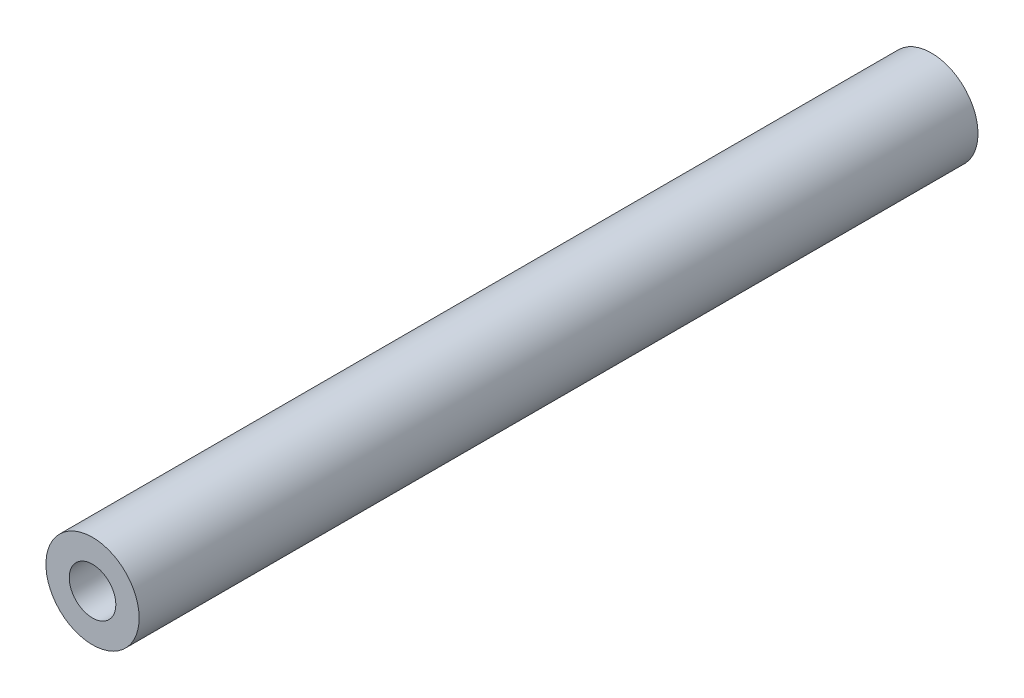
ISO-10303-21;
HEADER;
FILE_DESCRIPTION(('STEP AP214'),'2;1');
FILE_NAME('part.step','',(''),(''),'','','');
FILE_SCHEMA(('AUTOMOTIVE_DESIGN { 1 0 10303 214 1 1 1 1 }'));
ENDSEC;
DATA;
#1=APPLICATION_CONTEXT('core data for automotive mechanical design processes');
#2=APPLICATION_PROTOCOL_DEFINITION('international standard','automotive_design',2000,#1);
#3=PRODUCT_CONTEXT('',#1,'mechanical');
#4=PRODUCT('Part','Part','',(#3));
#5=PRODUCT_RELATED_PRODUCT_CATEGORY('part','',(#4));
#6=PRODUCT_DEFINITION_FORMATION('','',#4);
#7=PRODUCT_DEFINITION_CONTEXT('part definition',#1,'design');
#8=PRODUCT_DEFINITION('design','',#6,#7);
#9=PRODUCT_DEFINITION_SHAPE('','',#8);
#10=(LENGTH_UNIT() NAMED_UNIT(*) SI_UNIT(.MILLI.,.METRE.));
#11=(NAMED_UNIT(*) PLANE_ANGLE_UNIT() SI_UNIT($,.RADIAN.));
#12=(NAMED_UNIT(*) SI_UNIT($,.STERADIAN.) SOLID_ANGLE_UNIT());
#13=UNCERTAINTY_MEASURE_WITH_UNIT(LENGTH_MEASURE(1.E-05),#10,'distance_accuracy_value','');
#14=(GEOMETRIC_REPRESENTATION_CONTEXT(3) GLOBAL_UNCERTAINTY_ASSIGNED_CONTEXT((#13)) GLOBAL_UNIT_ASSIGNED_CONTEXT((#10,
#11,#12)) REPRESENTATION_CONTEXT('',''));
#15=CARTESIAN_POINT('',(0.,0.,0.));
#16=DIRECTION('',(0.,0.,1.));
#17=DIRECTION('',(1.,0.,0.));
#18=AXIS2_PLACEMENT_3D('',#15,#16,#17);
#19=CARTESIAN_POINT('',(0.,0.,45.));
#20=DIRECTION('',(0.,0.,1.));
#21=DIRECTION('',(1.,0.,0.));
#22=AXIS2_PLACEMENT_3D('',#19,#20,#21);
#23=PLANE('',#22);
#24=CARTESIAN_POINT('',(0.,0.,45.));
#25=DIRECTION('',(0.,0.,1.));
#26=DIRECTION('',(1.,0.,0.));
#27=AXIS2_PLACEMENT_3D('',#24,#25,#26);
#28=CIRCLE('',#27,2.5);
#29=CARTESIAN_POINT('',(2.5,0.,45.));
#30=VERTEX_POINT('',#29);
#31=EDGE_CURVE('E10',#30,#30,#28,.T.);
#32=ORIENTED_EDGE('',*,*,#31,.T.);
#33=EDGE_LOOP('',(#32));
#34=FACE_BOUND('',#33,.T.);
#35=CARTESIAN_POINT('',(0.,0.,45.));
#36=DIRECTION('',(0.,0.,1.));
#37=DIRECTION('',(1.,0.,0.));
#38=AXIS2_PLACEMENT_3D('',#35,#36,#37);
#39=CIRCLE('',#38,1.25);
#40=CARTESIAN_POINT('',(1.25,0.,45.));
#41=VERTEX_POINT('',#40);
#42=EDGE_CURVE('E42',#41,#41,#39,.T.);
#43=ORIENTED_EDGE('',*,*,#42,.F.);
#44=EDGE_LOOP('',(#43));
#45=FACE_BOUND('',#44,.T.);
#46=ADVANCED_FACE('F31',(#34,#45),#23,.T.);
#47=CARTESIAN_POINT('',(0.,0.,0.));
#48=DIRECTION('',(0.,0.,1.));
#49=DIRECTION('',(1.,0.,0.));
#50=AXIS2_PLACEMENT_3D('',#47,#48,#49);
#51=PLANE('',#50);
#52=CARTESIAN_POINT('',(0.,0.,0.));
#53=DIRECTION('',(0.,0.,1.));
#54=DIRECTION('',(1.,0.,0.));
#55=AXIS2_PLACEMENT_3D('',#52,#53,#54);
#56=CIRCLE('',#55,2.5);
#57=CARTESIAN_POINT('',(2.5,0.,0.));
#58=VERTEX_POINT('',#57);
#59=EDGE_CURVE('E35',#58,#58,#56,.T.);
#60=ORIENTED_EDGE('',*,*,#59,.F.);
#61=EDGE_LOOP('',(#60));
#62=FACE_BOUND('',#61,.T.);
#63=CARTESIAN_POINT('',(0.,0.,0.));
#64=DIRECTION('',(0.,0.,1.));
#65=DIRECTION('',(1.,0.,0.));
#66=AXIS2_PLACEMENT_3D('',#63,#64,#65);
#67=CIRCLE('',#66,1.25);
#68=CARTESIAN_POINT('',(1.25,0.,0.));
#69=VERTEX_POINT('',#68);
#70=EDGE_CURVE('E44',#69,#69,#67,.T.);
#71=ORIENTED_EDGE('',*,*,#70,.T.);
#72=EDGE_LOOP('',(#71));
#73=FACE_BOUND('',#72,.T.);
#74=ADVANCED_FACE('F54',(#62,#73),#51,.F.);
#75=CARTESIAN_POINT('',(0.,0.,45.));
#76=DIRECTION('',(0.,0.,-1.));
#77=DIRECTION('',(-1.,0.,0.));
#78=AXIS2_PLACEMENT_3D('',#75,#76,#77);
#79=CYLINDRICAL_SURFACE('',#78,2.5);
#80=ORIENTED_EDGE('',*,*,#31,.F.);
#81=EDGE_LOOP('',(#80));
#82=FACE_BOUND('',#81,.T.);
#83=ORIENTED_EDGE('',*,*,#59,.T.);
#84=EDGE_LOOP('',(#83));
#85=FACE_BOUND('',#84,.T.);
#86=ADVANCED_FACE('F33',(#82,#85),#79,.T.);
#87=CARTESIAN_POINT('',(0.,0.,45.));
#88=DIRECTION('',(0.,0.,-1.));
#89=DIRECTION('',(-1.,0.,0.));
#90=AXIS2_PLACEMENT_3D('',#87,#88,#89);
#91=CYLINDRICAL_SURFACE('',#90,1.25);
#92=ORIENTED_EDGE('',*,*,#42,.T.);
#93=EDGE_LOOP('',(#92));
#94=FACE_BOUND('',#93,.T.);
#95=ORIENTED_EDGE('',*,*,#70,.F.);
#96=EDGE_LOOP('',(#95));
#97=FACE_BOUND('',#96,.T.);
#98=ADVANCED_FACE('F50',(#94,#97),#91,.F.);
#99=CLOSED_SHELL('',(#46,#74,#86,#98));
#100=MANIFOLD_SOLID_BREP('B2',#99);
#101=ADVANCED_BREP_SHAPE_REPRESENTATION('',(#18,#100),#14);
#102=SHAPE_DEFINITION_REPRESENTATION(#9,#101);
ENDSEC;
END-ISO-10303-21;
